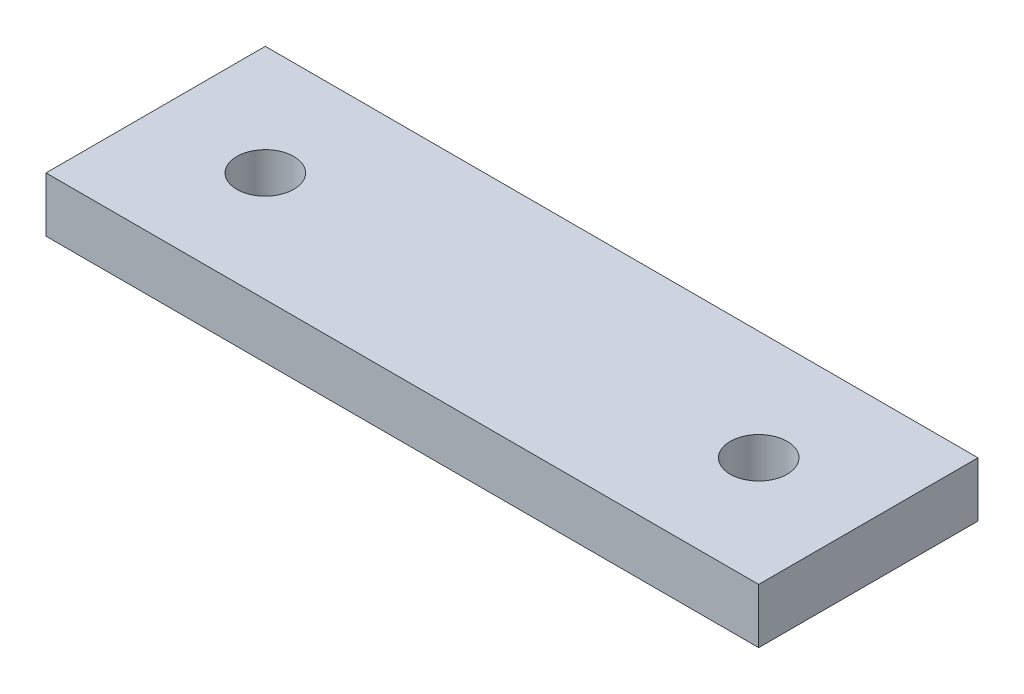
ISO-10303-21;
HEADER;
FILE_DESCRIPTION(('STEP AP214'),'2;1');
FILE_NAME('part.step','',(''),(''),'','','');
FILE_SCHEMA(('AUTOMOTIVE_DESIGN { 1 0 10303 214 1 1 1 1 }'));
ENDSEC;
DATA;
#1=APPLICATION_CONTEXT('core data for automotive mechanical design processes');
#2=APPLICATION_PROTOCOL_DEFINITION('international standard','automotive_design',2000,#1);
#3=PRODUCT_CONTEXT('',#1,'mechanical');
#4=PRODUCT('Part','Part','',(#3));
#5=PRODUCT_RELATED_PRODUCT_CATEGORY('part','',(#4));
#6=PRODUCT_DEFINITION_FORMATION('','',#4);
#7=PRODUCT_DEFINITION_CONTEXT('part definition',#1,'design');
#8=PRODUCT_DEFINITION('design','',#6,#7);
#9=PRODUCT_DEFINITION_SHAPE('','',#8);
#10=(LENGTH_UNIT() NAMED_UNIT(*) SI_UNIT(.MILLI.,.METRE.));
#11=(NAMED_UNIT(*) PLANE_ANGLE_UNIT() SI_UNIT($,.RADIAN.));
#12=(NAMED_UNIT(*) SI_UNIT($,.STERADIAN.) SOLID_ANGLE_UNIT());
#13=UNCERTAINTY_MEASURE_WITH_UNIT(LENGTH_MEASURE(1.E-05),#10,'distance_accuracy_value','');
#14=(GEOMETRIC_REPRESENTATION_CONTEXT(3) GLOBAL_UNCERTAINTY_ASSIGNED_CONTEXT((#13)) GLOBAL_UNIT_ASSIGNED_CONTEXT((#10,
#11,#12)) REPRESENTATION_CONTEXT('',''));
#15=CARTESIAN_POINT('',(0.,0.,0.));
#16=DIRECTION('',(0.,0.,1.));
#17=DIRECTION('',(1.,0.,0.));
#18=AXIS2_PLACEMENT_3D('',#15,#16,#17);
#19=CARTESIAN_POINT('',(0.,6.35,0.));
#20=DIRECTION('',(0.,-1.,0.));
#21=DIRECTION('',(0.,0.,-1.));
#22=AXIS2_PLACEMENT_3D('',#19,#20,#21);
#23=PLANE('',#22);
#24=DIRECTION('',(0.,0.,1.));
#25=VECTOR('',#24,1.);
#26=CARTESIAN_POINT('',(0.,6.35,0.));
#27=LINE('',#26,#25);
#28=CARTESIAN_POINT('',(0.,6.35,-25.4));
#29=VERTEX_POINT('',#28);
#30=CARTESIAN_POINT('',(0.,6.35,0.));
#31=VERTEX_POINT('',#30);
#32=EDGE_CURVE('E85',#29,#31,#27,.T.);
#33=ORIENTED_EDGE('',*,*,#32,.T.);
#34=DIRECTION('',(1.,0.,0.));
#35=VECTOR('',#34,1.);
#36=CARTESIAN_POINT('',(0.,6.35,0.));
#37=LINE('',#36,#35);
#38=CARTESIAN_POINT('',(82.55,6.35,0.));
#39=VERTEX_POINT('',#38);
#40=EDGE_CURVE('E80',#31,#39,#37,.T.);
#41=ORIENTED_EDGE('',*,*,#40,.T.);
#42=DIRECTION('',(0.,0.,-1.));
#43=VECTOR('',#42,1.);
#44=CARTESIAN_POINT('',(82.55,6.35,0.));
#45=LINE('',#44,#43);
#46=CARTESIAN_POINT('',(82.55,6.35,-25.4));
#47=VERTEX_POINT('',#46);
#48=EDGE_CURVE('E83',#39,#47,#45,.T.);
#49=ORIENTED_EDGE('',*,*,#48,.T.);
#50=DIRECTION('',(-1.,0.,0.));
#51=VECTOR('',#50,1.);
#52=CARTESIAN_POINT('',(0.,6.35,-25.4));
#53=LINE('',#52,#51);
#54=EDGE_CURVE('E50',#47,#29,#53,.T.);
#55=ORIENTED_EDGE('',*,*,#54,.T.);
#56=EDGE_LOOP('',(#33,#41,#49,#55));
#57=FACE_BOUND('',#56,.T.);
#58=CARTESIAN_POINT('',(12.7,6.35,-12.7));
#59=DIRECTION('',(0.,1.,0.));
#60=DIRECTION('',(0.,0.,1.));
#61=AXIS2_PLACEMENT_3D('',#58,#59,#60);
#62=CIRCLE('',#61,3.302);
#63=CARTESIAN_POINT('',(12.7,6.35,-9.398));
#64=VERTEX_POINT('',#63);
#65=EDGE_CURVE('E100',#64,#64,#62,.T.);
#66=ORIENTED_EDGE('',*,*,#65,.F.);
#67=EDGE_LOOP('',(#66));
#68=FACE_BOUND('',#67,.T.);
#69=CARTESIAN_POINT('',(69.85,6.35,-12.7));
#70=DIRECTION('',(0.,1.,0.));
#71=DIRECTION('',(0.,0.,1.));
#72=AXIS2_PLACEMENT_3D('',#69,#70,#71);
#73=CIRCLE('',#72,3.302);
#74=CARTESIAN_POINT('',(69.85,6.35,-9.398));
#75=VERTEX_POINT('',#74);
#76=EDGE_CURVE('E115',#75,#75,#73,.T.);
#77=ORIENTED_EDGE('',*,*,#76,.F.);
#78=EDGE_LOOP('',(#77));
#79=FACE_BOUND('',#78,.T.);
#80=ADVANCED_FACE('F33',(#57,#68,#79),#23,.F.);
#81=CARTESIAN_POINT('',(0.,0.,0.));
#82=DIRECTION('',(0.,-1.,0.));
#83=DIRECTION('',(0.,0.,-1.));
#84=AXIS2_PLACEMENT_3D('',#81,#82,#83);
#85=PLANE('',#84);
#86=CARTESIAN_POINT('',(12.7,0.,-12.7));
#87=DIRECTION('',(0.,1.,0.));
#88=DIRECTION('',(0.,0.,1.));
#89=AXIS2_PLACEMENT_3D('',#86,#87,#88);
#90=CIRCLE('',#89,3.302);
#91=CARTESIAN_POINT('',(12.7,0.,-9.398));
#92=VERTEX_POINT('',#91);
#93=EDGE_CURVE('E112',#92,#92,#90,.T.);
#94=ORIENTED_EDGE('',*,*,#93,.T.);
#95=EDGE_LOOP('',(#94));
#96=FACE_BOUND('',#95,.T.);
#97=DIRECTION('',(0.,0.,1.));
#98=VECTOR('',#97,1.);
#99=CARTESIAN_POINT('',(0.,0.,0.));
#100=LINE('',#99,#98);
#101=CARTESIAN_POINT('',(0.,0.,-25.4));
#102=VERTEX_POINT('',#101);
#103=CARTESIAN_POINT('',(0.,0.,0.));
#104=VERTEX_POINT('',#103);
#105=EDGE_CURVE('E97',#102,#104,#100,.T.);
#106=ORIENTED_EDGE('',*,*,#105,.F.);
#107=DIRECTION('',(-1.,0.,0.));
#108=VECTOR('',#107,1.);
#109=CARTESIAN_POINT('',(0.,0.,-25.4));
#110=LINE('',#109,#108);
#111=CARTESIAN_POINT('',(82.55,0.,-25.4));
#112=VERTEX_POINT('',#111);
#113=EDGE_CURVE('E73',#112,#102,#110,.T.);
#114=ORIENTED_EDGE('',*,*,#113,.F.);
#115=DIRECTION('',(0.,0.,-1.));
#116=VECTOR('',#115,1.);
#117=CARTESIAN_POINT('',(82.55,0.,0.));
#118=LINE('',#117,#116);
#119=CARTESIAN_POINT('',(82.55,0.,0.));
#120=VERTEX_POINT('',#119);
#121=EDGE_CURVE('E67',#120,#112,#118,.T.);
#122=ORIENTED_EDGE('',*,*,#121,.F.);
#123=DIRECTION('',(1.,0.,0.));
#124=VECTOR('',#123,1.);
#125=CARTESIAN_POINT('',(0.,0.,0.));
#126=LINE('',#125,#124);
#127=EDGE_CURVE('E89',#104,#120,#126,.T.);
#128=ORIENTED_EDGE('',*,*,#127,.F.);
#129=EDGE_LOOP('',(#106,#114,#122,#128));
#130=FACE_BOUND('',#129,.T.);
#131=CARTESIAN_POINT('',(69.85,0.,-12.7));
#132=DIRECTION('',(0.,1.,0.));
#133=DIRECTION('',(0.,0.,1.));
#134=AXIS2_PLACEMENT_3D('',#131,#132,#133);
#135=CIRCLE('',#134,3.302);
#136=CARTESIAN_POINT('',(69.85,0.,-9.398));
#137=VERTEX_POINT('',#136);
#138=EDGE_CURVE('E118',#137,#137,#135,.T.);
#139=ORIENTED_EDGE('',*,*,#138,.T.);
#140=EDGE_LOOP('',(#139));
#141=FACE_BOUND('',#140,.T.);
#142=ADVANCED_FACE('F108',(#96,#130,#141),#85,.T.);
#143=CARTESIAN_POINT('',(0.,6.35,0.));
#144=DIRECTION('',(1.,0.,0.));
#145=DIRECTION('',(0.,0.,-1.));
#146=AXIS2_PLACEMENT_3D('',#143,#144,#145);
#147=PLANE('',#146);
#148=ORIENTED_EDGE('',*,*,#105,.T.);
#149=DIRECTION('',(0.,-1.,0.));
#150=VECTOR('',#149,1.);
#151=CARTESIAN_POINT('',(0.,6.35,0.));
#152=LINE('',#151,#150);
#153=EDGE_CURVE('E11',#31,#104,#152,.T.);
#154=ORIENTED_EDGE('',*,*,#153,.F.);
#155=ORIENTED_EDGE('',*,*,#32,.F.);
#156=DIRECTION('',(0.,-1.,0.));
#157=VECTOR('',#156,1.);
#158=CARTESIAN_POINT('',(0.,6.35,-25.4));
#159=LINE('',#158,#157);
#160=EDGE_CURVE('E93',#29,#102,#159,.T.);
#161=ORIENTED_EDGE('',*,*,#160,.T.);
#162=EDGE_LOOP('',(#148,#154,#155,#161));
#163=FACE_BOUND('',#162,.T.);
#164=ADVANCED_FACE('F35',(#163),#147,.F.);
#165=CARTESIAN_POINT('',(0.,6.35,0.));
#166=DIRECTION('',(0.,0.,-1.));
#167=DIRECTION('',(-1.,0.,0.));
#168=AXIS2_PLACEMENT_3D('',#165,#166,#167);
#169=PLANE('',#168);
#170=ORIENTED_EDGE('',*,*,#127,.T.);
#171=DIRECTION('',(0.,-1.,0.));
#172=VECTOR('',#171,1.);
#173=CARTESIAN_POINT('',(82.55,6.35,0.));
#174=LINE('',#173,#172);
#175=EDGE_CURVE('E42',#39,#120,#174,.T.);
#176=ORIENTED_EDGE('',*,*,#175,.F.);
#177=ORIENTED_EDGE('',*,*,#40,.F.);
#178=ORIENTED_EDGE('',*,*,#153,.T.);
#179=EDGE_LOOP('',(#170,#176,#177,#178));
#180=FACE_BOUND('',#179,.T.);
#181=ADVANCED_FACE('F88',(#180),#169,.F.);
#182=CARTESIAN_POINT('',(82.55,6.35,0.));
#183=DIRECTION('',(-1.,0.,0.));
#184=DIRECTION('',(0.,0.,1.));
#185=AXIS2_PLACEMENT_3D('',#182,#183,#184);
#186=PLANE('',#185);
#187=ORIENTED_EDGE('',*,*,#121,.T.);
#188=DIRECTION('',(0.,-1.,0.));
#189=VECTOR('',#188,1.);
#190=CARTESIAN_POINT('',(82.55,6.35,-25.4));
#191=LINE('',#190,#189);
#192=EDGE_CURVE('E90',#47,#112,#191,.T.);
#193=ORIENTED_EDGE('',*,*,#192,.F.);
#194=ORIENTED_EDGE('',*,*,#48,.F.);
#195=ORIENTED_EDGE('',*,*,#175,.T.);
#196=EDGE_LOOP('',(#187,#193,#194,#195));
#197=FACE_BOUND('',#196,.T.);
#198=ADVANCED_FACE('F91',(#197),#186,.F.);
#199=CARTESIAN_POINT('',(0.,6.35,-25.4));
#200=DIRECTION('',(0.,0.,1.));
#201=DIRECTION('',(1.,0.,0.));
#202=AXIS2_PLACEMENT_3D('',#199,#200,#201);
#203=PLANE('',#202);
#204=ORIENTED_EDGE('',*,*,#113,.T.);
#205=ORIENTED_EDGE('',*,*,#160,.F.);
#206=ORIENTED_EDGE('',*,*,#54,.F.);
#207=ORIENTED_EDGE('',*,*,#192,.T.);
#208=EDGE_LOOP('',(#204,#205,#206,#207));
#209=FACE_BOUND('',#208,.T.);
#210=ADVANCED_FACE('F105',(#209),#203,.F.);
#211=CARTESIAN_POINT('',(12.7,6.35,-12.7));
#212=DIRECTION('',(0.,-1.,0.));
#213=DIRECTION('',(0.,0.,-1.));
#214=AXIS2_PLACEMENT_3D('',#211,#212,#213);
#215=CYLINDRICAL_SURFACE('',#214,3.302);
#216=ORIENTED_EDGE('',*,*,#65,.T.);
#217=EDGE_LOOP('',(#216));
#218=FACE_BOUND('',#217,.T.);
#219=ORIENTED_EDGE('',*,*,#93,.F.);
#220=EDGE_LOOP('',(#219));
#221=FACE_BOUND('',#220,.T.);
#222=ADVANCED_FACE('F135',(#218,#221),#215,.F.);
#223=CARTESIAN_POINT('',(69.85,6.35,-12.7));
#224=DIRECTION('',(0.,-1.,0.));
#225=DIRECTION('',(0.,0.,-1.));
#226=AXIS2_PLACEMENT_3D('',#223,#224,#225);
#227=CYLINDRICAL_SURFACE('',#226,3.302);
#228=ORIENTED_EDGE('',*,*,#76,.T.);
#229=EDGE_LOOP('',(#228));
#230=FACE_BOUND('',#229,.T.);
#231=ORIENTED_EDGE('',*,*,#138,.F.);
#232=EDGE_LOOP('',(#231));
#233=FACE_BOUND('',#232,.T.);
#234=ADVANCED_FACE('F124',(#230,#233),#227,.F.);
#235=CLOSED_SHELL('',(#80,#142,#164,#181,#198,#210,#222,#234));
#236=MANIFOLD_SOLID_BREP('B2',#235);
#237=ADVANCED_BREP_SHAPE_REPRESENTATION('',(#18,#236),#14);
#238=SHAPE_DEFINITION_REPRESENTATION(#9,#237);
ENDSEC;
END-ISO-10303-21;
